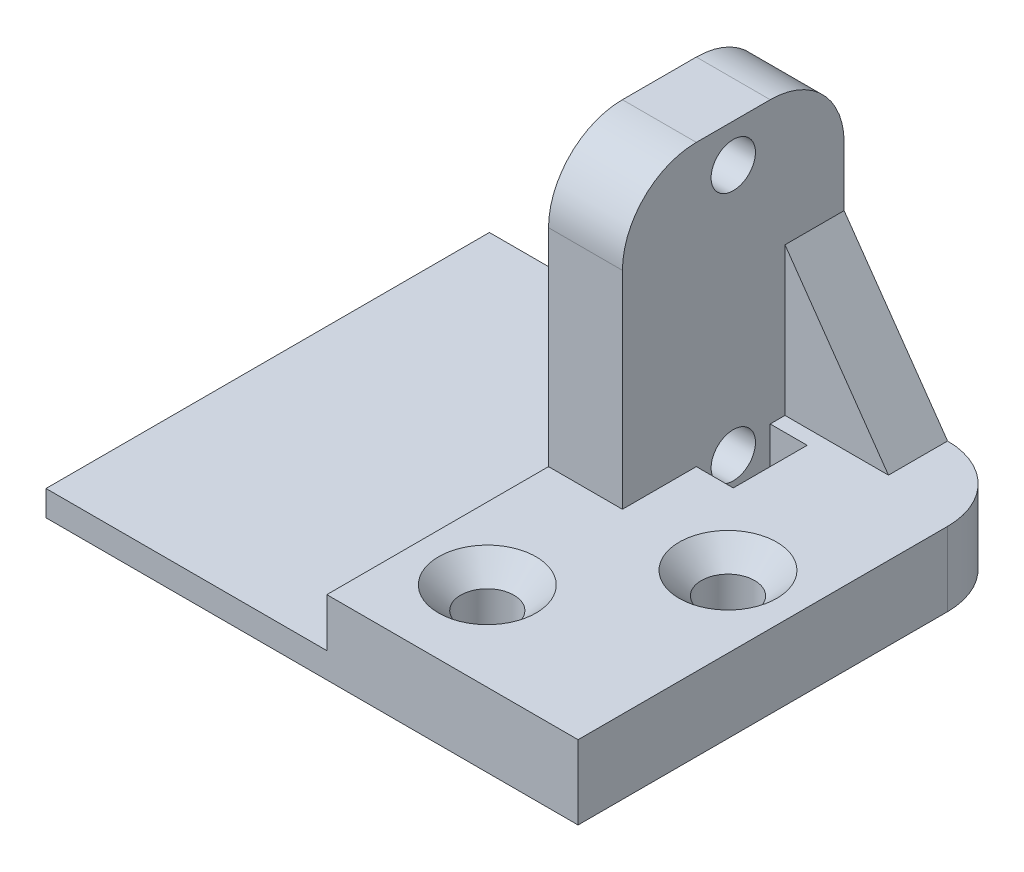
ISO-10303-21;
HEADER;
FILE_DESCRIPTION(('STEP AP214'),'2;1');
FILE_NAME('part.step','',(''),(''),'','','');
FILE_SCHEMA(('AUTOMOTIVE_DESIGN { 1 0 10303 214 1 1 1 1 }'));
ENDSEC;
DATA;
#1=APPLICATION_CONTEXT('core data for automotive mechanical design processes');
#2=APPLICATION_PROTOCOL_DEFINITION('international standard','automotive_design',2000,#1);
#3=PRODUCT_CONTEXT('',#1,'mechanical');
#4=PRODUCT('Part','Part','',(#3));
#5=PRODUCT_RELATED_PRODUCT_CATEGORY('part','',(#4));
#6=PRODUCT_DEFINITION_FORMATION('','',#4);
#7=PRODUCT_DEFINITION_CONTEXT('part definition',#1,'design');
#8=PRODUCT_DEFINITION('design','',#6,#7);
#9=PRODUCT_DEFINITION_SHAPE('','',#8);
#10=(LENGTH_UNIT() NAMED_UNIT(*) SI_UNIT(.MILLI.,.METRE.));
#11=(NAMED_UNIT(*) PLANE_ANGLE_UNIT() SI_UNIT($,.RADIAN.));
#12=(NAMED_UNIT(*) SI_UNIT($,.STERADIAN.) SOLID_ANGLE_UNIT());
#13=UNCERTAINTY_MEASURE_WITH_UNIT(LENGTH_MEASURE(1.E-05),#10,'distance_accuracy_value','');
#14=(GEOMETRIC_REPRESENTATION_CONTEXT(3) GLOBAL_UNCERTAINTY_ASSIGNED_CONTEXT((#13)) GLOBAL_UNIT_ASSIGNED_CONTEXT((#10,
#11,#12)) REPRESENTATION_CONTEXT('',''));
#15=CARTESIAN_POINT('',(0.,0.,0.));
#16=DIRECTION('',(0.,0.,1.));
#17=DIRECTION('',(1.,0.,0.));
#18=AXIS2_PLACEMENT_3D('',#15,#16,#17);
#19=CARTESIAN_POINT('',(5.,0.,0.));
#20=DIRECTION('',(1.,0.,0.));
#21=DIRECTION('',(0.,0.,-1.));
#22=AXIS2_PLACEMENT_3D('',#19,#20,#21);
#23=PLANE('',#22);
#24=DIRECTION('',(0.,0.,-1.));
#25=VECTOR('',#24,1.);
#26=CARTESIAN_POINT('',(5.,15.,0.));
#27=LINE('',#26,#25);
#28=CARTESIAN_POINT('',(5.,15.,-7.5));
#29=VERTEX_POINT('',#28);
#30=CARTESIAN_POINT('',(5.,15.,-3.5));
#31=VERTEX_POINT('',#30);
#32=EDGE_CURVE('E64',#29,#31,#27,.F.);
#33=ORIENTED_EDGE('',*,*,#32,.F.);
#34=DIRECTION('',(0.,1.,0.));
#35=VECTOR('',#34,1.);
#36=CARTESIAN_POINT('',(5.,24.,-7.5));
#37=LINE('',#36,#35);
#38=CARTESIAN_POINT('',(5.,19.,-7.5));
#39=VERTEX_POINT('',#38);
#40=EDGE_CURVE('E294',#29,#39,#37,.T.);
#41=ORIENTED_EDGE('',*,*,#40,.T.);
#42=CARTESIAN_POINT('',(5.,19.,-2.5));
#43=DIRECTION('',(1.,0.,0.));
#44=DIRECTION('',(0.,0.,-1.));
#45=AXIS2_PLACEMENT_3D('',#42,#43,#44);
#46=CIRCLE('',#45,5.);
#47=CARTESIAN_POINT('',(5.,24.,-2.5));
#48=VERTEX_POINT('',#47);
#49=EDGE_CURVE('E327',#39,#48,#46,.T.);
#50=ORIENTED_EDGE('',*,*,#49,.T.);
#51=DIRECTION('',(0.,0.,1.));
#52=VECTOR('',#51,1.);
#53=CARTESIAN_POINT('',(5.,24.,7.5));
#54=LINE('',#53,#52);
#55=CARTESIAN_POINT('',(5.,24.,2.5));
#56=VERTEX_POINT('',#55);
#57=EDGE_CURVE('E297',#48,#56,#54,.T.);
#58=ORIENTED_EDGE('',*,*,#57,.T.);
#59=CARTESIAN_POINT('',(5.,19.,2.5));
#60=DIRECTION('',(1.,0.,0.));
#61=DIRECTION('',(0.,0.,-1.));
#62=AXIS2_PLACEMENT_3D('',#59,#60,#61);
#63=CIRCLE('',#62,5.);
#64=CARTESIAN_POINT('',(5.,19.,7.5));
#65=VERTEX_POINT('',#64);
#66=EDGE_CURVE('E325',#56,#65,#63,.T.);
#67=ORIENTED_EDGE('',*,*,#66,.T.);
#68=DIRECTION('',(0.,-1.,0.));
#69=VECTOR('',#68,1.);
#70=CARTESIAN_POINT('',(5.,24.,7.5));
#71=LINE('',#70,#69);
#72=CARTESIAN_POINT('',(5.,5.,7.5));
#73=VERTEX_POINT('',#72);
#74=EDGE_CURVE('E292',#65,#73,#71,.T.);
#75=ORIENTED_EDGE('',*,*,#74,.T.);
#76=DIRECTION('',(0.,0.,1.));
#77=VECTOR('',#76,1.);
#78=CARTESIAN_POINT('',(5.,5.,-7.5));
#79=LINE('',#78,#77);
#80=CARTESIAN_POINT('',(5.,5.,2.5));
#81=VERTEX_POINT('',#80);
#82=EDGE_CURVE('E240',#81,#73,#79,.T.);
#83=ORIENTED_EDGE('',*,*,#82,.F.);
#84=DIRECTION('',(0.,1.,0.));
#85=VECTOR('',#84,1.);
#86=CARTESIAN_POINT('',(5.,2.,2.5));
#87=LINE('',#86,#85);
#88=CARTESIAN_POINT('',(5.,2.,2.5));
#89=VERTEX_POINT('',#88);
#90=EDGE_CURVE('E220',#89,#81,#87,.T.);
#91=ORIENTED_EDGE('',*,*,#90,.F.);
#92=DIRECTION('',(0.,0.,1.));
#93=VECTOR('',#92,1.);
#94=CARTESIAN_POINT('',(5.,2.,2.5));
#95=LINE('',#94,#93);
#96=CARTESIAN_POINT('',(5.,2.,-2.5));
#97=VERTEX_POINT('',#96);
#98=EDGE_CURVE('E207',#97,#89,#95,.T.);
#99=ORIENTED_EDGE('',*,*,#98,.F.);
#100=DIRECTION('',(0.,1.,0.));
#101=VECTOR('',#100,1.);
#102=CARTESIAN_POINT('',(5.,2.,-2.5));
#103=LINE('',#102,#101);
#104=CARTESIAN_POINT('',(5.,5.,-2.5));
#105=VERTEX_POINT('',#104);
#106=EDGE_CURVE('E228',#97,#105,#103,.T.);
#107=ORIENTED_EDGE('',*,*,#106,.T.);
#108=CARTESIAN_POINT('',(5.,5.,-3.5));
#109=VERTEX_POINT('',#108);
#110=EDGE_CURVE('E237',#109,#105,#79,.T.);
#111=ORIENTED_EDGE('',*,*,#110,.F.);
#112=DIRECTION('',(0.,1.,0.));
#113=VECTOR('',#112,1.);
#114=CARTESIAN_POINT('',(5.,0.,-3.5));
#115=LINE('',#114,#113);
#116=EDGE_CURVE('E60',#109,#31,#115,.T.);
#117=ORIENTED_EDGE('',*,*,#116,.T.);
#118=EDGE_LOOP('',(#33,#41,#50,#58,#67,#75,#83,#91,#99,#107,#111,#117));
#119=FACE_BOUND('',#118,.T.);
#120=CARTESIAN_POINT('',(5.,21.4200046323172,0.));
#121=DIRECTION('',(1.,0.,0.));
#122=DIRECTION('',(0.,0.,-1.));
#123=AXIS2_PLACEMENT_3D('',#120,#121,#122);
#124=CIRCLE('',#123,1.5);
#125=CARTESIAN_POINT('',(5.,21.4200046323172,-1.5));
#126=VERTEX_POINT('',#125);
#127=EDGE_CURVE('E280',#126,#126,#124,.T.);
#128=ORIENTED_EDGE('',*,*,#127,.F.);
#129=EDGE_LOOP('',(#128));
#130=FACE_BOUND('',#129,.T.);
#131=CARTESIAN_POINT('',(5.,4.42000463231724,0.));
#132=DIRECTION('',(1.,0.,0.));
#133=DIRECTION('',(0.,0.,-1.));
#134=AXIS2_PLACEMENT_3D('',#131,#132,#133);
#135=CIRCLE('',#134,1.5);
#136=CARTESIAN_POINT('',(5.,4.42000463231724,-1.5));
#137=VERTEX_POINT('',#136);
#138=EDGE_CURVE('E286',#137,#137,#135,.T.);
#139=ORIENTED_EDGE('',*,*,#138,.F.);
#140=EDGE_LOOP('',(#139));
#141=FACE_BOUND('',#140,.T.);
#142=ADVANCED_FACE('F45',(#119,#130,#141),#23,.T.);
#143=CARTESIAN_POINT('',(5.,24.,7.5));
#144=DIRECTION('',(0.,0.,-1.));
#145=DIRECTION('',(0.,1.,0.));
#146=AXIS2_PLACEMENT_3D('',#143,#144,#145);
#147=PLANE('',#146);
#148=ORIENTED_EDGE('',*,*,#74,.F.);
#149=DIRECTION('',(-1.,0.,0.));
#150=VECTOR('',#149,1.);
#151=CARTESIAN_POINT('',(5.,19.,7.5));
#152=LINE('',#151,#150);
#153=CARTESIAN_POINT('',(0.,19.,7.5));
#154=VERTEX_POINT('',#153);
#155=EDGE_CURVE('E53',#65,#154,#152,.T.);
#156=ORIENTED_EDGE('',*,*,#155,.T.);
#157=DIRECTION('',(0.,-1.,0.));
#158=VECTOR('',#157,1.);
#159=CARTESIAN_POINT('',(0.,24.,7.5));
#160=LINE('',#159,#158);
#161=CARTESIAN_POINT('',(0.,5.,7.5));
#162=VERTEX_POINT('',#161);
#163=EDGE_CURVE('E289',#154,#162,#160,.T.);
#164=ORIENTED_EDGE('',*,*,#163,.T.);
#165=DIRECTION('',(-1.,0.,0.));
#166=VECTOR('',#165,1.);
#167=CARTESIAN_POINT('',(5.,5.,7.5));
#168=LINE('',#167,#166);
#169=EDGE_CURVE('E239',#73,#162,#168,.T.);
#170=ORIENTED_EDGE('',*,*,#169,.F.);
#171=EDGE_LOOP('',(#148,#156,#164,#170));
#172=FACE_BOUND('',#171,.T.);
#173=ADVANCED_FACE('F333',(#172),#147,.F.);
#174=CARTESIAN_POINT('',(0.,0.,0.));
#175=DIRECTION('',(1.,0.,0.));
#176=DIRECTION('',(0.,0.,-1.));
#177=AXIS2_PLACEMENT_3D('',#174,#175,#176);
#178=PLANE('',#177);
#179=CARTESIAN_POINT('',(0.,21.4200046323172,0.));
#180=DIRECTION('',(1.,0.,0.));
#181=DIRECTION('',(0.,0.,-1.));
#182=AXIS2_PLACEMENT_3D('',#179,#180,#181);
#183=CIRCLE('',#182,1.5);
#184=CARTESIAN_POINT('',(0.,21.4200046323172,-1.5));
#185=VERTEX_POINT('',#184);
#186=EDGE_CURVE('E279',#185,#185,#183,.T.);
#187=ORIENTED_EDGE('',*,*,#186,.T.);
#188=EDGE_LOOP('',(#187));
#189=FACE_BOUND('',#188,.T.);
#190=CARTESIAN_POINT('',(0.,4.42000463231724,0.));
#191=DIRECTION('',(1.,0.,0.));
#192=DIRECTION('',(0.,0.,-1.));
#193=AXIS2_PLACEMENT_3D('',#190,#191,#192);
#194=CIRCLE('',#193,1.5);
#195=CARTESIAN_POINT('',(0.,4.42000463231724,-1.5));
#196=VERTEX_POINT('',#195);
#197=EDGE_CURVE('E283',#196,#196,#194,.T.);
#198=ORIENTED_EDGE('',*,*,#197,.T.);
#199=EDGE_LOOP('',(#198));
#200=FACE_BOUND('',#199,.T.);
#201=CARTESIAN_POINT('',(0.,19.,-2.5));
#202=DIRECTION('',(1.,0.,0.));
#203=DIRECTION('',(0.,0.,-1.));
#204=AXIS2_PLACEMENT_3D('',#201,#202,#203);
#205=CIRCLE('',#204,5.);
#206=CARTESIAN_POINT('',(0.,24.,-2.5));
#207=VERTEX_POINT('',#206);
#208=CARTESIAN_POINT('',(0.,19.,-7.5));
#209=VERTEX_POINT('',#208);
#210=EDGE_CURVE('E323',#207,#209,#205,.F.);
#211=ORIENTED_EDGE('',*,*,#210,.T.);
#212=DIRECTION('',(0.,1.,0.));
#213=VECTOR('',#212,1.);
#214=CARTESIAN_POINT('',(0.,24.,-7.5));
#215=LINE('',#214,#213);
#216=CARTESIAN_POINT('',(0.,1.72000463231724,-7.5));
#217=VERTEX_POINT('',#216);
#218=EDGE_CURVE('E301',#217,#209,#215,.T.);
#219=ORIENTED_EDGE('',*,*,#218,.F.);
#220=DIRECTION('',(0.,0.,-1.));
#221=VECTOR('',#220,1.);
#222=CARTESIAN_POINT('',(0.,1.72000463231725,22.5));
#223=LINE('',#222,#221);
#224=CARTESIAN_POINT('',(0.,1.72000463231725,22.5));
#225=VERTEX_POINT('',#224);
#226=EDGE_CURVE('E268',#225,#217,#223,.T.);
#227=ORIENTED_EDGE('',*,*,#226,.F.);
#228=DIRECTION('',(0.,-1.,0.));
#229=VECTOR('',#228,1.);
#230=CARTESIAN_POINT('',(0.,5.,22.5));
#231=LINE('',#230,#229);
#232=CARTESIAN_POINT('',(0.,5.,22.5));
#233=VERTEX_POINT('',#232);
#234=EDGE_CURVE('E254',#233,#225,#231,.T.);
#235=ORIENTED_EDGE('',*,*,#234,.F.);
#236=DIRECTION('',(0.,0.,1.));
#237=VECTOR('',#236,1.);
#238=CARTESIAN_POINT('',(0.,5.,7.5));
#239=LINE('',#238,#237);
#240=EDGE_CURVE('E243',#162,#233,#239,.T.);
#241=ORIENTED_EDGE('',*,*,#240,.F.);
#242=ORIENTED_EDGE('',*,*,#163,.F.);
#243=CARTESIAN_POINT('',(0.,19.,2.5));
#244=DIRECTION('',(1.,0.,0.));
#245=DIRECTION('',(0.,0.,-1.));
#246=AXIS2_PLACEMENT_3D('',#243,#244,#245);
#247=CIRCLE('',#246,5.);
#248=CARTESIAN_POINT('',(0.,24.,2.5));
#249=VERTEX_POINT('',#248);
#250=EDGE_CURVE('E321',#154,#249,#247,.F.);
#251=ORIENTED_EDGE('',*,*,#250,.T.);
#252=DIRECTION('',(0.,0.,1.));
#253=VECTOR('',#252,1.);
#254=CARTESIAN_POINT('',(0.,24.,7.5));
#255=LINE('',#254,#253);
#256=EDGE_CURVE('E295',#207,#249,#255,.T.);
#257=ORIENTED_EDGE('',*,*,#256,.F.);
#258=EDGE_LOOP('',(#211,#219,#227,#235,#241,#242,#251,#257));
#259=FACE_BOUND('',#258,.T.);
#260=ADVANCED_FACE('F339',(#189,#200,#259),#178,.F.);
#261=CARTESIAN_POINT('',(5.,0.,7.5));
#262=DIRECTION('',(0.,1.,0.));
#263=DIRECTION('',(0.,0.,1.));
#264=AXIS2_PLACEMENT_3D('',#261,#262,#263);
#265=PLANE('',#264);
#266=CARTESIAN_POINT('',(12.,0.,-2.5));
#267=DIRECTION('',(0.,1.,0.));
#268=DIRECTION('',(0.,0.,1.));
#269=AXIS2_PLACEMENT_3D('',#266,#267,#268);
#270=CIRCLE('',#269,5.);
#271=CARTESIAN_POINT('',(12.,0.,-7.5));
#272=VERTEX_POINT('',#271);
#273=CARTESIAN_POINT('',(17.,0.,-2.5));
#274=VERTEX_POINT('',#273);
#275=EDGE_CURVE('E311',#272,#274,#270,.F.);
#276=ORIENTED_EDGE('',*,*,#275,.T.);
#277=DIRECTION('',(0.,0.,-1.));
#278=VECTOR('',#277,1.);
#279=CARTESIAN_POINT('',(17.,0.,-7.5));
#280=LINE('',#279,#278);
#281=CARTESIAN_POINT('',(17.,0.,22.5));
#282=VERTEX_POINT('',#281);
#283=EDGE_CURVE('E231',#282,#274,#280,.T.);
#284=ORIENTED_EDGE('',*,*,#283,.F.);
#285=DIRECTION('',(1.,0.,0.));
#286=VECTOR('',#285,1.);
#287=CARTESIAN_POINT('',(-19.,0.,22.5));
#288=LINE('',#287,#286);
#289=CARTESIAN_POINT('',(-19.,0.,22.5));
#290=VERTEX_POINT('',#289);
#291=EDGE_CURVE('E267',#290,#282,#288,.T.);
#292=ORIENTED_EDGE('',*,*,#291,.F.);
#293=DIRECTION('',(0.,0.,1.));
#294=VECTOR('',#293,1.);
#295=CARTESIAN_POINT('',(-19.,0.,22.5));
#296=LINE('',#295,#294);
#297=CARTESIAN_POINT('',(-19.,0.,-7.5));
#298=VERTEX_POINT('',#297);
#299=EDGE_CURVE('E265',#298,#290,#296,.T.);
#300=ORIENTED_EDGE('',*,*,#299,.F.);
#301=DIRECTION('',(-1.,0.,0.));
#302=VECTOR('',#301,1.);
#303=CARTESIAN_POINT('',(5.,0.,-7.5));
#304=LINE('',#303,#302);
#305=EDGE_CURVE('E271',#272,#298,#304,.T.);
#306=ORIENTED_EDGE('',*,*,#305,.F.);
#307=EDGE_LOOP('',(#276,#284,#292,#300,#306));
#308=FACE_BOUND('',#307,.T.);
#309=CARTESIAN_POINT('',(4.85714285714286,0.,16.5));
#310=DIRECTION('',(0.,1.,0.));
#311=DIRECTION('',(0.,0.,1.));
#312=AXIS2_PLACEMENT_3D('',#309,#310,#311);
#313=CIRCLE('',#312,1.79999999999999);
#314=CARTESIAN_POINT('',(4.85714285714286,0.,18.3));
#315=VERTEX_POINT('',#314);
#316=EDGE_CURVE('E194',#315,#315,#313,.T.);
#317=ORIENTED_EDGE('',*,*,#316,.T.);
#318=EDGE_LOOP('',(#317));
#319=FACE_BOUND('',#318,.T.);
#320=CARTESIAN_POINT('',(12.1428571428571,0.,7.5));
#321=DIRECTION('',(0.,1.,0.));
#322=DIRECTION('',(0.,0.,1.));
#323=AXIS2_PLACEMENT_3D('',#320,#321,#322);
#324=CIRCLE('',#323,1.79999999999999);
#325=CARTESIAN_POINT('',(12.1428571428571,0.,9.29999999999999));
#326=VERTEX_POINT('',#325);
#327=EDGE_CURVE('E203',#326,#326,#324,.T.);
#328=ORIENTED_EDGE('',*,*,#327,.T.);
#329=EDGE_LOOP('',(#328));
#330=FACE_BOUND('',#329,.T.);
#331=ADVANCED_FACE('F369',(#308,#319,#330),#265,.F.);
#332=CARTESIAN_POINT('',(5.,24.,-7.5));
#333=DIRECTION('',(0.,0.,1.));
#334=DIRECTION('',(0.,-1.,0.));
#335=AXIS2_PLACEMENT_3D('',#332,#333,#334);
#336=PLANE('',#335);
#337=ORIENTED_EDGE('',*,*,#40,.F.);
#338=DIRECTION('',(-0.573462344363328,0.81923192051904,0.));
#339=VECTOR('',#338,1.);
#340=CARTESIAN_POINT('',(12.,5.,-7.5));
#341=LINE('',#340,#339);
#342=CARTESIAN_POINT('',(12.,5.,-7.5));
#343=VERTEX_POINT('',#342);
#344=EDGE_CURVE('E176',#343,#29,#341,.T.);
#345=ORIENTED_EDGE('',*,*,#344,.F.);
#346=DIRECTION('',(0.,-1.,0.));
#347=VECTOR('',#346,1.);
#348=CARTESIAN_POINT('',(12.,24.,-7.5));
#349=LINE('',#348,#347);
#350=EDGE_CURVE('E308',#343,#272,#349,.T.);
#351=ORIENTED_EDGE('',*,*,#350,.T.);
#352=ORIENTED_EDGE('',*,*,#305,.T.);
#353=DIRECTION('',(0.,-1.,0.));
#354=VECTOR('',#353,1.);
#355=CARTESIAN_POINT('',(-19.,0.,-7.5));
#356=LINE('',#355,#354);
#357=CARTESIAN_POINT('',(-19.,1.72000463231724,-7.5));
#358=VERTEX_POINT('',#357);
#359=EDGE_CURVE('E262',#358,#298,#356,.T.);
#360=ORIENTED_EDGE('',*,*,#359,.F.);
#361=DIRECTION('',(1.,0.,0.));
#362=VECTOR('',#361,1.);
#363=CARTESIAN_POINT('',(-19.,1.72000463231724,-7.5));
#364=LINE('',#363,#362);
#365=EDGE_CURVE('E273',#358,#217,#364,.T.);
#366=ORIENTED_EDGE('',*,*,#365,.T.);
#367=ORIENTED_EDGE('',*,*,#218,.T.);
#368=DIRECTION('',(-1.,0.,0.));
#369=VECTOR('',#368,1.);
#370=CARTESIAN_POINT('',(5.,19.,-7.5));
#371=LINE('',#370,#369);
#372=EDGE_CURVE('E270',#209,#39,#371,.F.);
#373=ORIENTED_EDGE('',*,*,#372,.T.);
#374=EDGE_LOOP('',(#337,#345,#351,#352,#360,#366,#367,#373));
#375=FACE_BOUND('',#374,.T.);
#376=ADVANCED_FACE('F360',(#375),#336,.F.);
#377=CARTESIAN_POINT('',(5.,24.,7.5));
#378=DIRECTION('',(0.,-1.,0.));
#379=DIRECTION('',(0.,0.,-1.));
#380=AXIS2_PLACEMENT_3D('',#377,#378,#379);
#381=PLANE('',#380);
#382=ORIENTED_EDGE('',*,*,#57,.F.);
#383=DIRECTION('',(-1.,0.,0.));
#384=VECTOR('',#383,1.);
#385=CARTESIAN_POINT('',(5.,24.,-2.5));
#386=LINE('',#385,#384);
#387=EDGE_CURVE('E318',#48,#207,#386,.T.);
#388=ORIENTED_EDGE('',*,*,#387,.T.);
#389=ORIENTED_EDGE('',*,*,#256,.T.);
#390=DIRECTION('',(-1.,0.,0.));
#391=VECTOR('',#390,1.);
#392=CARTESIAN_POINT('',(5.,24.,2.5));
#393=LINE('',#392,#391);
#394=EDGE_CURVE('E316',#249,#56,#393,.F.);
#395=ORIENTED_EDGE('',*,*,#394,.T.);
#396=EDGE_LOOP('',(#382,#388,#389,#395));
#397=FACE_BOUND('',#396,.T.);
#398=ADVANCED_FACE('F354',(#397),#381,.F.);
#399=CARTESIAN_POINT('',(5.,4.42000463231724,0.));
#400=DIRECTION('',(-1.,0.,0.));
#401=DIRECTION('',(0.,0.,1.));
#402=AXIS2_PLACEMENT_3D('',#399,#400,#401);
#403=CYLINDRICAL_SURFACE('',#402,1.5);
#404=ORIENTED_EDGE('',*,*,#138,.T.);
#405=EDGE_LOOP('',(#404));
#406=FACE_BOUND('',#405,.T.);
#407=ORIENTED_EDGE('',*,*,#197,.F.);
#408=EDGE_LOOP('',(#407));
#409=FACE_BOUND('',#408,.T.);
#410=ADVANCED_FACE('F407',(#406,#409),#403,.F.);
#411=CARTESIAN_POINT('',(5.,21.4200046323172,0.));
#412=DIRECTION('',(-1.,0.,0.));
#413=DIRECTION('',(0.,0.,1.));
#414=AXIS2_PLACEMENT_3D('',#411,#412,#413);
#415=CYLINDRICAL_SURFACE('',#414,1.5);
#416=ORIENTED_EDGE('',*,*,#127,.T.);
#417=EDGE_LOOP('',(#416));
#418=FACE_BOUND('',#417,.T.);
#419=ORIENTED_EDGE('',*,*,#186,.F.);
#420=EDGE_LOOP('',(#419));
#421=FACE_BOUND('',#420,.T.);
#422=ADVANCED_FACE('F560',(#418,#421),#415,.F.);
#423=CARTESIAN_POINT('',(-19.,0.,22.5));
#424=DIRECTION('',(0.,0.,-1.));
#425=DIRECTION('',(-1.,0.,0.));
#426=AXIS2_PLACEMENT_3D('',#423,#424,#425);
#427=PLANE('',#426);
#428=ORIENTED_EDGE('',*,*,#291,.T.);
#429=DIRECTION('',(0.,-1.,0.));
#430=VECTOR('',#429,1.);
#431=CARTESIAN_POINT('',(17.,5.,22.5));
#432=LINE('',#431,#430);
#433=CARTESIAN_POINT('',(17.,5.,22.5));
#434=VERTEX_POINT('',#433);
#435=EDGE_CURVE('E249',#434,#282,#432,.T.);
#436=ORIENTED_EDGE('',*,*,#435,.F.);
#437=DIRECTION('',(1.,0.,0.));
#438=VECTOR('',#437,1.);
#439=CARTESIAN_POINT('',(0.,5.,22.5));
#440=LINE('',#439,#438);
#441=EDGE_CURVE('E245',#233,#434,#440,.T.);
#442=ORIENTED_EDGE('',*,*,#441,.F.);
#443=ORIENTED_EDGE('',*,*,#234,.T.);
#444=DIRECTION('',(1.,0.,0.));
#445=VECTOR('',#444,1.);
#446=CARTESIAN_POINT('',(-19.,1.72000463231725,22.5));
#447=LINE('',#446,#445);
#448=CARTESIAN_POINT('',(-19.,1.72000463231725,22.5));
#449=VERTEX_POINT('',#448);
#450=EDGE_CURVE('E276',#449,#225,#447,.T.);
#451=ORIENTED_EDGE('',*,*,#450,.F.);
#452=DIRECTION('',(0.,1.,0.));
#453=VECTOR('',#452,1.);
#454=CARTESIAN_POINT('',(-19.,0.,22.5));
#455=LINE('',#454,#453);
#456=EDGE_CURVE('E257',#290,#449,#455,.T.);
#457=ORIENTED_EDGE('',*,*,#456,.F.);
#458=EDGE_LOOP('',(#428,#436,#442,#443,#451,#457));
#459=FACE_BOUND('',#458,.T.);
#460=ADVANCED_FACE('F380',(#459),#427,.F.);
#461=CARTESIAN_POINT('',(-19.,1.72000463231725,22.5));
#462=DIRECTION('',(0.,-1.,0.));
#463=DIRECTION('',(0.,0.,-1.));
#464=AXIS2_PLACEMENT_3D('',#461,#462,#463);
#465=PLANE('',#464);
#466=ORIENTED_EDGE('',*,*,#365,.F.);
#467=DIRECTION('',(0.,0.,-1.));
#468=VECTOR('',#467,1.);
#469=CARTESIAN_POINT('',(-19.,1.72000463231725,22.5));
#470=LINE('',#469,#468);
#471=EDGE_CURVE('E260',#449,#358,#470,.T.);
#472=ORIENTED_EDGE('',*,*,#471,.F.);
#473=ORIENTED_EDGE('',*,*,#450,.T.);
#474=ORIENTED_EDGE('',*,*,#226,.T.);
#475=EDGE_LOOP('',(#466,#472,#473,#474));
#476=FACE_BOUND('',#475,.T.);
#477=ADVANCED_FACE('F378',(#476),#465,.F.);
#478=CARTESIAN_POINT('',(-19.,0.,0.));
#479=DIRECTION('',(-1.,0.,0.));
#480=DIRECTION('',(0.,0.,1.));
#481=AXIS2_PLACEMENT_3D('',#478,#479,#480);
#482=PLANE('',#481);
#483=ORIENTED_EDGE('',*,*,#299,.T.);
#484=ORIENTED_EDGE('',*,*,#456,.T.);
#485=ORIENTED_EDGE('',*,*,#471,.T.);
#486=ORIENTED_EDGE('',*,*,#359,.T.);
#487=EDGE_LOOP('',(#483,#484,#485,#486));
#488=FACE_BOUND('',#487,.T.);
#489=ADVANCED_FACE('F375',(#488),#482,.T.);
#490=CARTESIAN_POINT('',(17.,5.,-7.5));
#491=DIRECTION('',(-1.,0.,0.));
#492=DIRECTION('',(0.,0.,1.));
#493=AXIS2_PLACEMENT_3D('',#490,#491,#492);
#494=PLANE('',#493);
#495=ORIENTED_EDGE('',*,*,#283,.T.);
#496=DIRECTION('',(0.,-1.,0.));
#497=VECTOR('',#496,1.);
#498=CARTESIAN_POINT('',(17.,5.,-2.5));
#499=LINE('',#498,#497);
#500=CARTESIAN_POINT('',(17.,5.,-2.5));
#501=VERTEX_POINT('',#500);
#502=EDGE_CURVE('E313',#274,#501,#499,.F.);
#503=ORIENTED_EDGE('',*,*,#502,.T.);
#504=DIRECTION('',(0.,0.,-1.));
#505=VECTOR('',#504,1.);
#506=CARTESIAN_POINT('',(17.,5.,-7.5));
#507=LINE('',#506,#505);
#508=EDGE_CURVE('E247',#434,#501,#507,.T.);
#509=ORIENTED_EDGE('',*,*,#508,.F.);
#510=ORIENTED_EDGE('',*,*,#435,.T.);
#511=EDGE_LOOP('',(#495,#503,#509,#510));
#512=FACE_BOUND('',#511,.T.);
#513=ADVANCED_FACE('F383',(#512),#494,.F.);
#514=CARTESIAN_POINT('',(0.,5.,0.));
#515=DIRECTION('',(0.,-1.,0.));
#516=DIRECTION('',(0.,0.,-1.));
#517=AXIS2_PLACEMENT_3D('',#514,#515,#516);
#518=PLANE('',#517);
#519=CARTESIAN_POINT('',(4.85714285714286,5.,16.5));
#520=DIRECTION('',(0.,1.,0.));
#521=DIRECTION('',(0.,0.,1.));
#522=AXIS2_PLACEMENT_3D('',#519,#520,#521);
#523=CIRCLE('',#522,3.3);
#524=CARTESIAN_POINT('',(4.85714285714286,5.,19.8));
#525=VERTEX_POINT('',#524);
#526=EDGE_CURVE('E188',#525,#525,#523,.T.);
#527=ORIENTED_EDGE('',*,*,#526,.F.);
#528=EDGE_LOOP('',(#527));
#529=FACE_BOUND('',#528,.T.);
#530=CARTESIAN_POINT('',(12.1428571428571,5.,7.5));
#531=DIRECTION('',(0.,1.,0.));
#532=DIRECTION('',(0.,0.,1.));
#533=AXIS2_PLACEMENT_3D('',#530,#531,#532);
#534=CIRCLE('',#533,3.3);
#535=CARTESIAN_POINT('',(12.1428571428571,5.,10.8));
#536=VERTEX_POINT('',#535);
#537=EDGE_CURVE('E197',#536,#536,#534,.T.);
#538=ORIENTED_EDGE('',*,*,#537,.F.);
#539=EDGE_LOOP('',(#538));
#540=FACE_BOUND('',#539,.T.);
#541=CARTESIAN_POINT('',(12.,5.,-2.5));
#542=DIRECTION('',(0.,-1.,0.));
#543=DIRECTION('',(0.,0.,-1.));
#544=AXIS2_PLACEMENT_3D('',#541,#542,#543);
#545=CIRCLE('',#544,5.);
#546=EDGE_CURVE('E170',#501,#343,#545,.F.);
#547=ORIENTED_EDGE('',*,*,#546,.T.);
#548=DIRECTION('',(0.,0.,-1.));
#549=VECTOR('',#548,1.);
#550=CARTESIAN_POINT('',(12.,5.,0.));
#551=LINE('',#550,#549);
#552=CARTESIAN_POINT('',(12.,5.,-3.5));
#553=VERTEX_POINT('',#552);
#554=EDGE_CURVE('E166',#343,#553,#551,.F.);
#555=ORIENTED_EDGE('',*,*,#554,.T.);
#556=DIRECTION('',(1.,0.,0.));
#557=VECTOR('',#556,1.);
#558=CARTESIAN_POINT('',(0.,5.,-3.5));
#559=LINE('',#558,#557);
#560=EDGE_CURVE('E13',#109,#553,#559,.T.);
#561=ORIENTED_EDGE('',*,*,#560,.F.);
#562=ORIENTED_EDGE('',*,*,#110,.T.);
#563=DIRECTION('',(-1.,0.,0.));
#564=VECTOR('',#563,1.);
#565=CARTESIAN_POINT('',(5.,5.,-2.5));
#566=LINE('',#565,#564);
#567=CARTESIAN_POINT('',(7.5,5.,-2.5));
#568=VERTEX_POINT('',#567);
#569=EDGE_CURVE('E211',#568,#105,#566,.T.);
#570=ORIENTED_EDGE('',*,*,#569,.F.);
#571=DIRECTION('',(0.,0.,-1.));
#572=VECTOR('',#571,1.);
#573=CARTESIAN_POINT('',(7.5,5.,2.5));
#574=LINE('',#573,#572);
#575=CARTESIAN_POINT('',(7.5,5.,2.5));
#576=VERTEX_POINT('',#575);
#577=EDGE_CURVE('E223',#576,#568,#574,.T.);
#578=ORIENTED_EDGE('',*,*,#577,.F.);
#579=DIRECTION('',(1.,0.,0.));
#580=VECTOR('',#579,1.);
#581=CARTESIAN_POINT('',(5.,5.,2.5));
#582=LINE('',#581,#580);
#583=EDGE_CURVE('E206',#81,#576,#582,.T.);
#584=ORIENTED_EDGE('',*,*,#583,.F.);
#585=ORIENTED_EDGE('',*,*,#82,.T.);
#586=ORIENTED_EDGE('',*,*,#169,.T.);
#587=ORIENTED_EDGE('',*,*,#240,.T.);
#588=ORIENTED_EDGE('',*,*,#441,.T.);
#589=ORIENTED_EDGE('',*,*,#508,.T.);
#590=EDGE_LOOP('',(#547,#555,#561,#562,#570,#578,#584,#585,#586,#587,#588,#589));
#591=FACE_BOUND('',#590,.T.);
#592=ADVANCED_FACE('F167',(#529,#540,#591),#518,.F.);
#593=CARTESIAN_POINT('',(5.,2.,-2.5));
#594=DIRECTION('',(0.,0.,-1.));
#595=DIRECTION('',(-1.,0.,0.));
#596=AXIS2_PLACEMENT_3D('',#593,#594,#595);
#597=PLANE('',#596);
#598=ORIENTED_EDGE('',*,*,#569,.T.);
#599=ORIENTED_EDGE('',*,*,#106,.F.);
#600=DIRECTION('',(-1.,0.,0.));
#601=VECTOR('',#600,1.);
#602=CARTESIAN_POINT('',(5.,2.,-2.5));
#603=LINE('',#602,#601);
#604=CARTESIAN_POINT('',(7.5,2.,-2.5));
#605=VERTEX_POINT('',#604);
#606=EDGE_CURVE('E217',#605,#97,#603,.T.);
#607=ORIENTED_EDGE('',*,*,#606,.F.);
#608=DIRECTION('',(0.,1.,0.));
#609=VECTOR('',#608,1.);
#610=CARTESIAN_POINT('',(7.5,2.,-2.5));
#611=LINE('',#610,#609);
#612=EDGE_CURVE('E232',#605,#568,#611,.T.);
#613=ORIENTED_EDGE('',*,*,#612,.T.);
#614=EDGE_LOOP('',(#598,#599,#607,#613));
#615=FACE_BOUND('',#614,.T.);
#616=ADVANCED_FACE('F449',(#615),#597,.F.);
#617=CARTESIAN_POINT('',(7.5,2.,2.5));
#618=DIRECTION('',(1.,0.,0.));
#619=DIRECTION('',(0.,0.,-1.));
#620=AXIS2_PLACEMENT_3D('',#617,#618,#619);
#621=PLANE('',#620);
#622=ORIENTED_EDGE('',*,*,#577,.T.);
#623=ORIENTED_EDGE('',*,*,#612,.F.);
#624=DIRECTION('',(0.,0.,-1.));
#625=VECTOR('',#624,1.);
#626=CARTESIAN_POINT('',(7.5,2.,2.5));
#627=LINE('',#626,#625);
#628=CARTESIAN_POINT('',(7.5,2.,2.5));
#629=VERTEX_POINT('',#628);
#630=EDGE_CURVE('E214',#629,#605,#627,.T.);
#631=ORIENTED_EDGE('',*,*,#630,.F.);
#632=DIRECTION('',(0.,1.,0.));
#633=VECTOR('',#632,1.);
#634=CARTESIAN_POINT('',(7.5,2.,2.5));
#635=LINE('',#634,#633);
#636=EDGE_CURVE('E234',#629,#576,#635,.T.);
#637=ORIENTED_EDGE('',*,*,#636,.T.);
#638=EDGE_LOOP('',(#622,#623,#631,#637));
#639=FACE_BOUND('',#638,.T.);
#640=ADVANCED_FACE('F464',(#639),#621,.F.);
#641=CARTESIAN_POINT('',(5.,2.,2.5));
#642=DIRECTION('',(0.,0.,1.));
#643=DIRECTION('',(1.,0.,0.));
#644=AXIS2_PLACEMENT_3D('',#641,#642,#643);
#645=PLANE('',#644);
#646=ORIENTED_EDGE('',*,*,#583,.T.);
#647=ORIENTED_EDGE('',*,*,#636,.F.);
#648=DIRECTION('',(1.,0.,0.));
#649=VECTOR('',#648,1.);
#650=CARTESIAN_POINT('',(5.,2.,2.5));
#651=LINE('',#650,#649);
#652=EDGE_CURVE('E210',#89,#629,#651,.T.);
#653=ORIENTED_EDGE('',*,*,#652,.F.);
#654=ORIENTED_EDGE('',*,*,#90,.T.);
#655=EDGE_LOOP('',(#646,#647,#653,#654));
#656=FACE_BOUND('',#655,.T.);
#657=ADVANCED_FACE('F394',(#656),#645,.F.);
#658=CARTESIAN_POINT('',(0.,2.,0.));
#659=DIRECTION('',(0.,-1.,0.));
#660=DIRECTION('',(0.,0.,-1.));
#661=AXIS2_PLACEMENT_3D('',#658,#659,#660);
#662=PLANE('',#661);
#663=ORIENTED_EDGE('',*,*,#98,.T.);
#664=ORIENTED_EDGE('',*,*,#652,.T.);
#665=ORIENTED_EDGE('',*,*,#630,.T.);
#666=ORIENTED_EDGE('',*,*,#606,.T.);
#667=EDGE_LOOP('',(#663,#664,#665,#666));
#668=FACE_BOUND('',#667,.T.);
#669=ADVANCED_FACE('F387',(#668),#662,.F.);
#670=CARTESIAN_POINT('',(12.,24.,-2.5));
#671=DIRECTION('',(0.,-1.,0.));
#672=DIRECTION('',(0.,0.,-1.));
#673=AXIS2_PLACEMENT_3D('',#670,#671,#672);
#674=CYLINDRICAL_SURFACE('',#673,5.);
#675=ORIENTED_EDGE('',*,*,#502,.F.);
#676=ORIENTED_EDGE('',*,*,#275,.F.);
#677=ORIENTED_EDGE('',*,*,#350,.F.);
#678=ORIENTED_EDGE('',*,*,#546,.F.);
#679=EDGE_LOOP('',(#675,#676,#677,#678));
#680=FACE_BOUND('',#679,.T.);
#681=ADVANCED_FACE('F385',(#680),#674,.T.);
#682=CARTESIAN_POINT('',(5.,19.,-2.5));
#683=DIRECTION('',(-1.,0.,0.));
#684=DIRECTION('',(0.,0.,1.));
#685=AXIS2_PLACEMENT_3D('',#682,#683,#684);
#686=CYLINDRICAL_SURFACE('',#685,5.);
#687=ORIENTED_EDGE('',*,*,#49,.F.);
#688=ORIENTED_EDGE('',*,*,#372,.F.);
#689=ORIENTED_EDGE('',*,*,#210,.F.);
#690=ORIENTED_EDGE('',*,*,#387,.F.);
#691=EDGE_LOOP('',(#687,#688,#689,#690));
#692=FACE_BOUND('',#691,.T.);
#693=ADVANCED_FACE('F364',(#692),#686,.T.);
#694=CARTESIAN_POINT('',(5.,19.,2.5));
#695=DIRECTION('',(-1.,0.,0.));
#696=DIRECTION('',(0.,0.,1.));
#697=AXIS2_PLACEMENT_3D('',#694,#695,#696);
#698=CYLINDRICAL_SURFACE('',#697,5.);
#699=ORIENTED_EDGE('',*,*,#66,.F.);
#700=ORIENTED_EDGE('',*,*,#394,.F.);
#701=ORIENTED_EDGE('',*,*,#250,.F.);
#702=ORIENTED_EDGE('',*,*,#155,.F.);
#703=EDGE_LOOP('',(#699,#700,#701,#702));
#704=FACE_BOUND('',#703,.T.);
#705=ADVANCED_FACE('F47',(#704),#698,.T.);
#706=CARTESIAN_POINT('',(12.1428571428571,5.,7.5));
#707=DIRECTION('',(0.,1.,0.));
#708=DIRECTION('',(0.,0.,1.));
#709=AXIS2_PLACEMENT_3D('',#706,#707,#708);
#710=CYLINDRICAL_SURFACE('',#709,1.79999999999999);
#711=ORIENTED_EDGE('',*,*,#327,.F.);
#712=EDGE_LOOP('',(#711));
#713=FACE_BOUND('',#712,.T.);
#714=CARTESIAN_POINT('',(12.1428571428571,3.5,7.5));
#715=DIRECTION('',(0.,1.,0.));
#716=DIRECTION('',(0.,0.,1.));
#717=AXIS2_PLACEMENT_3D('',#714,#715,#716);
#718=CIRCLE('',#717,1.79999999999999);
#719=CARTESIAN_POINT('',(12.1428571428571,3.5,9.29999999999999));
#720=VERTEX_POINT('',#719);
#721=EDGE_CURVE('E200',#720,#720,#718,.T.);
#722=ORIENTED_EDGE('',*,*,#721,.T.);
#723=EDGE_LOOP('',(#722));
#724=FACE_BOUND('',#723,.T.);
#725=ADVANCED_FACE('F502',(#713,#724),#710,.F.);
#726=CARTESIAN_POINT('',(12.1428571428571,5.,7.5));
#727=DIRECTION('',(0.,1.,0.));
#728=DIRECTION('',(0.,0.,1.));
#729=AXIS2_PLACEMENT_3D('',#726,#727,#728);
#730=CONICAL_SURFACE('',#729,3.3,0.785398163397452);
#731=ORIENTED_EDGE('',*,*,#721,.F.);
#732=EDGE_LOOP('',(#731));
#733=FACE_BOUND('',#732,.T.);
#734=ORIENTED_EDGE('',*,*,#537,.T.);
#735=EDGE_LOOP('',(#734));
#736=FACE_BOUND('',#735,.T.);
#737=ADVANCED_FACE('F512',(#733,#736),#730,.F.);
#738=CARTESIAN_POINT('',(4.85714285714286,5.,16.5));
#739=DIRECTION('',(0.,1.,0.));
#740=DIRECTION('',(0.,0.,1.));
#741=AXIS2_PLACEMENT_3D('',#738,#739,#740);
#742=CYLINDRICAL_SURFACE('',#741,1.79999999999999);
#743=ORIENTED_EDGE('',*,*,#316,.F.);
#744=EDGE_LOOP('',(#743));
#745=FACE_BOUND('',#744,.T.);
#746=CARTESIAN_POINT('',(4.85714285714286,3.5,16.5));
#747=DIRECTION('',(0.,1.,0.));
#748=DIRECTION('',(0.,0.,1.));
#749=AXIS2_PLACEMENT_3D('',#746,#747,#748);
#750=CIRCLE('',#749,1.79999999999999);
#751=CARTESIAN_POINT('',(4.85714285714286,3.5,18.3));
#752=VERTEX_POINT('',#751);
#753=EDGE_CURVE('E191',#752,#752,#750,.T.);
#754=ORIENTED_EDGE('',*,*,#753,.T.);
#755=EDGE_LOOP('',(#754));
#756=FACE_BOUND('',#755,.T.);
#757=ADVANCED_FACE('F522',(#745,#756),#742,.F.);
#758=CARTESIAN_POINT('',(4.85714285714286,5.,16.5));
#759=DIRECTION('',(0.,1.,0.));
#760=DIRECTION('',(0.,0.,1.));
#761=AXIS2_PLACEMENT_3D('',#758,#759,#760);
#762=CONICAL_SURFACE('',#761,3.3,0.785398163397451);
#763=ORIENTED_EDGE('',*,*,#753,.F.);
#764=EDGE_LOOP('',(#763));
#765=FACE_BOUND('',#764,.T.);
#766=ORIENTED_EDGE('',*,*,#526,.T.);
#767=EDGE_LOOP('',(#766));
#768=FACE_BOUND('',#767,.T.);
#769=ADVANCED_FACE('F531',(#765,#768),#762,.F.);
#770=CARTESIAN_POINT('',(12.,5.,-7.5));
#771=DIRECTION('',(-0.81923192051904,-0.573462344363328,0.));
#772=DIRECTION('',(-0.573462344363328,0.81923192051904,0.));
#773=AXIS2_PLACEMENT_3D('',#770,#771,#772);
#774=PLANE('',#773);
#775=ORIENTED_EDGE('',*,*,#344,.T.);
#776=ORIENTED_EDGE('',*,*,#32,.T.);
#777=DIRECTION('',(-0.573462344363328,0.81923192051904,0.));
#778=VECTOR('',#777,1.);
#779=CARTESIAN_POINT('',(12.,5.,-3.5));
#780=LINE('',#779,#778);
#781=EDGE_CURVE('E181',#553,#31,#780,.T.);
#782=ORIENTED_EDGE('',*,*,#781,.F.);
#783=ORIENTED_EDGE('',*,*,#554,.F.);
#784=EDGE_LOOP('',(#775,#776,#782,#783));
#785=FACE_BOUND('',#784,.T.);
#786=ADVANCED_FACE('F182',(#785),#774,.F.);
#787=CARTESIAN_POINT('',(-0.999999999999997,12.,-3.5));
#788=DIRECTION('',(0.,0.,-1.));
#789=DIRECTION('',(0.,1.,0.));
#790=AXIS2_PLACEMENT_3D('',#787,#788,#789);
#791=PLANE('',#790);
#792=ORIENTED_EDGE('',*,*,#116,.F.);
#793=ORIENTED_EDGE('',*,*,#560,.T.);
#794=ORIENTED_EDGE('',*,*,#781,.T.);
#795=EDGE_LOOP('',(#792,#793,#794));
#796=FACE_BOUND('',#795,.T.);
#797=ADVANCED_FACE('F180',(#796),#791,.F.);
#798=CLOSED_SHELL('',(#142,#173,#260,#331,#376,#398,#410,#422,#460,#477,#489,#513,#592,#616,
#640,#657,#669,#681,#693,#705,#725,#737,#757,#769,#786,#797));
#799=MANIFOLD_SOLID_BREP('B2',#798);
#800=ADVANCED_BREP_SHAPE_REPRESENTATION('',(#18,#799),#14);
#801=SHAPE_DEFINITION_REPRESENTATION(#9,#800);
ENDSEC;
END-ISO-10303-21;
